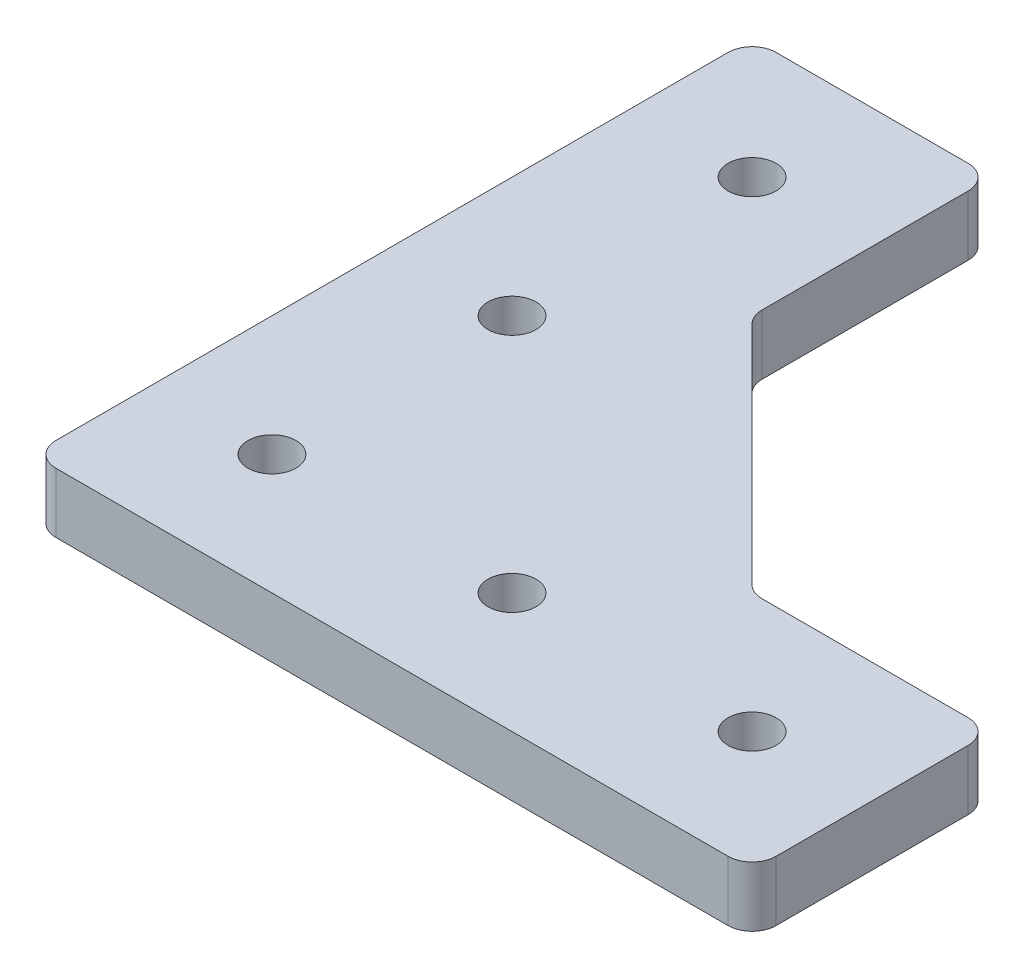
ISO-10303-21;
HEADER;
FILE_DESCRIPTION(('STEP AP214'),'2;1');
FILE_NAME('part.step','',(''),(''),'','','');
FILE_SCHEMA(('AUTOMOTIVE_DESIGN { 1 0 10303 214 1 1 1 1 }'));
ENDSEC;
DATA;
#1=APPLICATION_CONTEXT('core data for automotive mechanical design processes');
#2=APPLICATION_PROTOCOL_DEFINITION('international standard','automotive_design',2000,#1);
#3=PRODUCT_CONTEXT('',#1,'mechanical');
#4=PRODUCT('Part','Part','',(#3));
#5=PRODUCT_RELATED_PRODUCT_CATEGORY('part','',(#4));
#6=PRODUCT_DEFINITION_FORMATION('','',#4);
#7=PRODUCT_DEFINITION_CONTEXT('part definition',#1,'design');
#8=PRODUCT_DEFINITION('design','',#6,#7);
#9=PRODUCT_DEFINITION_SHAPE('','',#8);
#10=(LENGTH_UNIT() NAMED_UNIT(*) SI_UNIT(.MILLI.,.METRE.));
#11=(NAMED_UNIT(*) PLANE_ANGLE_UNIT() SI_UNIT($,.RADIAN.));
#12=(NAMED_UNIT(*) SI_UNIT($,.STERADIAN.) SOLID_ANGLE_UNIT());
#13=UNCERTAINTY_MEASURE_WITH_UNIT(LENGTH_MEASURE(1.E-05),#10,'distance_accuracy_value','');
#14=(GEOMETRIC_REPRESENTATION_CONTEXT(3) GLOBAL_UNCERTAINTY_ASSIGNED_CONTEXT((#13)) GLOBAL_UNIT_ASSIGNED_CONTEXT((#10,
#11,#12)) REPRESENTATION_CONTEXT('',''));
#15=CARTESIAN_POINT('',(0.,0.,0.));
#16=DIRECTION('',(0.,0.,1.));
#17=DIRECTION('',(1.,0.,0.));
#18=AXIS2_PLACEMENT_3D('',#15,#16,#17);
#19=CARTESIAN_POINT('',(0.,5.,10.));
#20=DIRECTION('',(0.,0.,1.));
#21=DIRECTION('',(1.,0.,0.));
#22=AXIS2_PLACEMENT_3D('',#19,#20,#21);
#23=PLANE('',#22);
#24=DIRECTION('',(-1.,0.,0.));
#25=VECTOR('',#24,1.);
#26=CARTESIAN_POINT('',(0.,5.,10.));
#27=LINE('',#26,#25);
#28=CARTESIAN_POINT('',(48.,5.,10.));
#29=VERTEX_POINT('',#28);
#30=CARTESIAN_POINT('',(-8.,5.,10.));
#31=VERTEX_POINT('',#30);
#32=EDGE_CURVE('E295',#29,#31,#27,.T.);
#33=ORIENTED_EDGE('',*,*,#32,.T.);
#34=DIRECTION('',(0.,-1.,0.));
#35=VECTOR('',#34,1.);
#36=CARTESIAN_POINT('',(-8.,0.,10.));
#37=LINE('',#36,#35);
#38=CARTESIAN_POINT('',(-8.,0.,10.));
#39=VERTEX_POINT('',#38);
#40=EDGE_CURVE('E164',#31,#39,#37,.T.);
#41=ORIENTED_EDGE('',*,*,#40,.T.);
#42=DIRECTION('',(-1.,0.,0.));
#43=VECTOR('',#42,1.);
#44=CARTESIAN_POINT('',(0.,0.,10.));
#45=LINE('',#44,#43);
#46=CARTESIAN_POINT('',(48.,0.,10.));
#47=VERTEX_POINT('',#46);
#48=EDGE_CURVE('E147',#47,#39,#45,.T.);
#49=ORIENTED_EDGE('',*,*,#48,.F.);
#50=DIRECTION('',(0.,-1.,0.));
#51=VECTOR('',#50,1.);
#52=CARTESIAN_POINT('',(48.,5.,10.));
#53=LINE('',#52,#51);
#54=EDGE_CURVE('E161',#47,#29,#53,.F.);
#55=ORIENTED_EDGE('',*,*,#54,.T.);
#56=EDGE_LOOP('',(#33,#41,#49,#55));
#57=FACE_BOUND('',#56,.T.);
#58=ADVANCED_FACE('F41',(#57),#23,.T.);
#59=CARTESIAN_POINT('',(50.,5.,0.));
#60=DIRECTION('',(1.,0.,0.));
#61=DIRECTION('',(0.,0.,-1.));
#62=AXIS2_PLACEMENT_3D('',#59,#60,#61);
#63=PLANE('',#62);
#64=DIRECTION('',(0.,0.,1.));
#65=VECTOR('',#64,1.);
#66=CARTESIAN_POINT('',(50.,5.,0.));
#67=LINE('',#66,#65);
#68=CARTESIAN_POINT('',(50.,5.,-8.));
#69=VERTEX_POINT('',#68);
#70=CARTESIAN_POINT('',(50.,5.,8.));
#71=VERTEX_POINT('',#70);
#72=EDGE_CURVE('E298',#69,#71,#67,.T.);
#73=ORIENTED_EDGE('',*,*,#72,.T.);
#74=DIRECTION('',(0.,-1.,0.));
#75=VECTOR('',#74,1.);
#76=CARTESIAN_POINT('',(50.,5.,8.));
#77=LINE('',#76,#75);
#78=CARTESIAN_POINT('',(50.,0.,8.));
#79=VERTEX_POINT('',#78);
#80=EDGE_CURVE('E225',#71,#79,#77,.T.);
#81=ORIENTED_EDGE('',*,*,#80,.T.);
#82=DIRECTION('',(0.,0.,1.));
#83=VECTOR('',#82,1.);
#84=CARTESIAN_POINT('',(50.,0.,0.));
#85=LINE('',#84,#83);
#86=CARTESIAN_POINT('',(50.,0.,-8.));
#87=VERTEX_POINT('',#86);
#88=EDGE_CURVE('E149',#87,#79,#85,.T.);
#89=ORIENTED_EDGE('',*,*,#88,.F.);
#90=DIRECTION('',(0.,-1.,0.));
#91=VECTOR('',#90,1.);
#92=CARTESIAN_POINT('',(50.,5.,-8.));
#93=LINE('',#92,#91);
#94=EDGE_CURVE('E222',#87,#69,#93,.F.);
#95=ORIENTED_EDGE('',*,*,#94,.T.);
#96=EDGE_LOOP('',(#73,#81,#89,#95));
#97=FACE_BOUND('',#96,.T.);
#98=ADVANCED_FACE('F369',(#97),#63,.T.);
#99=CARTESIAN_POINT('',(0.,5.,-10.));
#100=DIRECTION('',(0.,0.,1.));
#101=DIRECTION('',(1.,0.,0.));
#102=AXIS2_PLACEMENT_3D('',#99,#100,#101);
#103=PLANE('',#102);
#104=DIRECTION('',(-1.,0.,0.));
#105=VECTOR('',#104,1.);
#106=CARTESIAN_POINT('',(0.,0.,-10.));
#107=LINE('',#106,#105);
#108=CARTESIAN_POINT('',(48.,0.,-10.));
#109=VERTEX_POINT('',#108);
#110=CARTESIAN_POINT('',(30.8284271247462,0.,-10.));
#111=VERTEX_POINT('',#110);
#112=EDGE_CURVE('E258',#109,#111,#107,.T.);
#113=ORIENTED_EDGE('',*,*,#112,.T.);
#114=DIRECTION('',(0.,1.,0.));
#115=VECTOR('',#114,1.);
#116=CARTESIAN_POINT('',(30.8284271247462,5.,-10.));
#117=LINE('',#116,#115);
#118=CARTESIAN_POINT('',(30.8284271247462,5.,-10.));
#119=VERTEX_POINT('',#118);
#120=EDGE_CURVE('E235',#111,#119,#117,.T.);
#121=ORIENTED_EDGE('',*,*,#120,.T.);
#122=DIRECTION('',(-1.,0.,0.));
#123=VECTOR('',#122,1.);
#124=CARTESIAN_POINT('',(0.,5.,-10.));
#125=LINE('',#124,#123);
#126=CARTESIAN_POINT('',(48.,5.,-10.));
#127=VERTEX_POINT('',#126);
#128=EDGE_CURVE('E277',#127,#119,#125,.T.);
#129=ORIENTED_EDGE('',*,*,#128,.F.);
#130=DIRECTION('',(0.,-1.,0.));
#131=VECTOR('',#130,1.);
#132=CARTESIAN_POINT('',(48.,0.,-10.));
#133=LINE('',#132,#131);
#134=EDGE_CURVE('E231',#127,#109,#133,.T.);
#135=ORIENTED_EDGE('',*,*,#134,.T.);
#136=EDGE_LOOP('',(#113,#121,#129,#135));
#137=FACE_BOUND('',#136,.T.);
#138=ADVANCED_FACE('F265',(#137),#103,.F.);
#139=CARTESIAN_POINT('',(10.,5.,0.));
#140=DIRECTION('',(1.,0.,0.));
#141=DIRECTION('',(0.,0.,-1.));
#142=AXIS2_PLACEMENT_3D('',#139,#140,#141);
#143=PLANE('',#142);
#144=DIRECTION('',(0.,0.,1.));
#145=VECTOR('',#144,1.);
#146=CARTESIAN_POINT('',(10.,5.,0.));
#147=LINE('',#146,#145);
#148=CARTESIAN_POINT('',(10.,5.,-48.));
#149=VERTEX_POINT('',#148);
#150=CARTESIAN_POINT('',(10.,5.,-30.8284271247462));
#151=VERTEX_POINT('',#150);
#152=EDGE_CURVE('E304',#149,#151,#147,.T.);
#153=ORIENTED_EDGE('',*,*,#152,.T.);
#154=DIRECTION('',(0.,1.,0.));
#155=VECTOR('',#154,1.);
#156=CARTESIAN_POINT('',(10.,0.,-30.8284271247462));
#157=LINE('',#156,#155);
#158=CARTESIAN_POINT('',(10.,0.,-30.8284271247462));
#159=VERTEX_POINT('',#158);
#160=EDGE_CURVE('E63',#151,#159,#157,.F.);
#161=ORIENTED_EDGE('',*,*,#160,.T.);
#162=DIRECTION('',(0.,0.,1.));
#163=VECTOR('',#162,1.);
#164=CARTESIAN_POINT('',(10.,0.,0.));
#165=LINE('',#164,#163);
#166=CARTESIAN_POINT('',(10.,0.,-48.));
#167=VERTEX_POINT('',#166);
#168=EDGE_CURVE('E270',#167,#159,#165,.T.);
#169=ORIENTED_EDGE('',*,*,#168,.F.);
#170=DIRECTION('',(0.,-1.,0.));
#171=VECTOR('',#170,1.);
#172=CARTESIAN_POINT('',(10.,5.,-48.));
#173=LINE('',#172,#171);
#174=EDGE_CURVE('E228',#167,#149,#173,.F.);
#175=ORIENTED_EDGE('',*,*,#174,.T.);
#176=EDGE_LOOP('',(#153,#161,#169,#175));
#177=FACE_BOUND('',#176,.T.);
#178=ADVANCED_FACE('F450',(#177),#143,.T.);
#179=CARTESIAN_POINT('',(0.,5.,-50.));
#180=DIRECTION('',(0.,0.,-1.));
#181=DIRECTION('',(-1.,0.,0.));
#182=AXIS2_PLACEMENT_3D('',#179,#180,#181);
#183=PLANE('',#182);
#184=DIRECTION('',(1.,0.,0.));
#185=VECTOR('',#184,1.);
#186=CARTESIAN_POINT('',(0.,0.,-50.));
#187=LINE('',#186,#185);
#188=CARTESIAN_POINT('',(-8.,0.,-50.));
#189=VERTEX_POINT('',#188);
#190=CARTESIAN_POINT('',(8.,0.,-50.));
#191=VERTEX_POINT('',#190);
#192=EDGE_CURVE('E332',#189,#191,#187,.T.);
#193=ORIENTED_EDGE('',*,*,#192,.F.);
#194=DIRECTION('',(0.,-1.,0.));
#195=VECTOR('',#194,1.);
#196=CARTESIAN_POINT('',(-8.,5.,-50.));
#197=LINE('',#196,#195);
#198=CARTESIAN_POINT('',(-8.,5.,-50.));
#199=VERTEX_POINT('',#198);
#200=EDGE_CURVE('E219',#189,#199,#197,.F.);
#201=ORIENTED_EDGE('',*,*,#200,.T.);
#202=DIRECTION('',(1.,0.,0.));
#203=VECTOR('',#202,1.);
#204=CARTESIAN_POINT('',(0.,5.,-50.));
#205=LINE('',#204,#203);
#206=CARTESIAN_POINT('',(8.,5.,-50.));
#207=VERTEX_POINT('',#206);
#208=EDGE_CURVE('E307',#199,#207,#205,.T.);
#209=ORIENTED_EDGE('',*,*,#208,.T.);
#210=DIRECTION('',(0.,-1.,0.));
#211=VECTOR('',#210,1.);
#212=CARTESIAN_POINT('',(8.,5.,-50.));
#213=LINE('',#212,#211);
#214=EDGE_CURVE('E215',#207,#191,#213,.T.);
#215=ORIENTED_EDGE('',*,*,#214,.T.);
#216=EDGE_LOOP('',(#193,#201,#209,#215));
#217=FACE_BOUND('',#216,.T.);
#218=ADVANCED_FACE('F458',(#217),#183,.T.);
#219=CARTESIAN_POINT('',(0.,5.,-20.));
#220=DIRECTION('',(0.,-1.,0.));
#221=DIRECTION('',(0.,0.,-1.));
#222=AXIS2_PLACEMENT_3D('',#219,#220,#221);
#223=CYLINDRICAL_SURFACE('',#222,2.);
#224=CARTESIAN_POINT('',(0.,5.,-20.));
#225=DIRECTION('',(0.,1.,0.));
#226=DIRECTION('',(0.,0.,1.));
#227=AXIS2_PLACEMENT_3D('',#224,#225,#226);
#228=CIRCLE('',#227,2.);
#229=CARTESIAN_POINT('',(0.,5.,-18.));
#230=VERTEX_POINT('',#229);
#231=EDGE_CURVE('E179',#230,#230,#228,.T.);
#232=ORIENTED_EDGE('',*,*,#231,.T.);
#233=EDGE_LOOP('',(#232));
#234=FACE_BOUND('',#233,.T.);
#235=CARTESIAN_POINT('',(0.,0.,-20.));
#236=DIRECTION('',(0.,1.,0.));
#237=DIRECTION('',(0.,0.,1.));
#238=AXIS2_PLACEMENT_3D('',#235,#236,#237);
#239=CIRCLE('',#238,2.);
#240=CARTESIAN_POINT('',(0.,0.,-18.));
#241=VERTEX_POINT('',#240);
#242=EDGE_CURVE('E343',#241,#241,#239,.T.);
#243=ORIENTED_EDGE('',*,*,#242,.F.);
#244=EDGE_LOOP('',(#243));
#245=FACE_BOUND('',#244,.T.);
#246=ADVANCED_FACE('F542',(#234,#245),#223,.F.);
#247=CARTESIAN_POINT('',(0.,5.,0.));
#248=DIRECTION('',(0.,-1.,0.));
#249=DIRECTION('',(0.,0.,-1.));
#250=AXIS2_PLACEMENT_3D('',#247,#248,#249);
#251=CYLINDRICAL_SURFACE('',#250,2.);
#252=CARTESIAN_POINT('',(0.,5.,0.));
#253=DIRECTION('',(0.,1.,0.));
#254=DIRECTION('',(0.,0.,1.));
#255=AXIS2_PLACEMENT_3D('',#252,#253,#254);
#256=CIRCLE('',#255,2.);
#257=CARTESIAN_POINT('',(0.,5.,2.));
#258=VERTEX_POINT('',#257);
#259=EDGE_CURVE('E315',#258,#258,#256,.T.);
#260=ORIENTED_EDGE('',*,*,#259,.T.);
#261=EDGE_LOOP('',(#260));
#262=FACE_BOUND('',#261,.T.);
#263=CARTESIAN_POINT('',(0.,0.,0.));
#264=DIRECTION('',(0.,1.,0.));
#265=DIRECTION('',(0.,0.,1.));
#266=AXIS2_PLACEMENT_3D('',#263,#264,#265);
#267=CIRCLE('',#266,2.);
#268=CARTESIAN_POINT('',(0.,0.,2.));
#269=VERTEX_POINT('',#268);
#270=EDGE_CURVE('E340',#269,#269,#267,.T.);
#271=ORIENTED_EDGE('',*,*,#270,.F.);
#272=EDGE_LOOP('',(#271));
#273=FACE_BOUND('',#272,.T.);
#274=ADVANCED_FACE('F530',(#262,#273),#251,.F.);
#275=CARTESIAN_POINT('',(-10.,5.,0.));
#276=DIRECTION('',(1.,0.,0.));
#277=DIRECTION('',(0.,0.,-1.));
#278=AXIS2_PLACEMENT_3D('',#275,#276,#277);
#279=PLANE('',#278);
#280=DIRECTION('',(0.,0.,1.));
#281=VECTOR('',#280,1.);
#282=CARTESIAN_POINT('',(-10.,0.,0.));
#283=LINE('',#282,#281);
#284=CARTESIAN_POINT('',(-10.,0.,-48.));
#285=VERTEX_POINT('',#284);
#286=CARTESIAN_POINT('',(-10.,0.,8.));
#287=VERTEX_POINT('',#286);
#288=EDGE_CURVE('E336',#285,#287,#283,.T.);
#289=ORIENTED_EDGE('',*,*,#288,.T.);
#290=DIRECTION('',(0.,-1.,0.));
#291=VECTOR('',#290,1.);
#292=CARTESIAN_POINT('',(-10.,5.,8.));
#293=LINE('',#292,#291);
#294=CARTESIAN_POINT('',(-10.,5.,8.));
#295=VERTEX_POINT('',#294);
#296=EDGE_CURVE('E198',#287,#295,#293,.F.);
#297=ORIENTED_EDGE('',*,*,#296,.T.);
#298=DIRECTION('',(0.,0.,1.));
#299=VECTOR('',#298,1.);
#300=CARTESIAN_POINT('',(-10.,5.,0.));
#301=LINE('',#300,#299);
#302=CARTESIAN_POINT('',(-10.,5.,-48.));
#303=VERTEX_POINT('',#302);
#304=EDGE_CURVE('E311',#303,#295,#301,.T.);
#305=ORIENTED_EDGE('',*,*,#304,.F.);
#306=DIRECTION('',(0.,-1.,0.));
#307=VECTOR('',#306,1.);
#308=CARTESIAN_POINT('',(-10.,0.,-48.));
#309=LINE('',#308,#307);
#310=EDGE_CURVE('E194',#303,#285,#309,.T.);
#311=ORIENTED_EDGE('',*,*,#310,.T.);
#312=EDGE_LOOP('',(#289,#297,#305,#311));
#313=FACE_BOUND('',#312,.T.);
#314=ADVANCED_FACE('F379',(#313),#279,.F.);
#315=CARTESIAN_POINT('',(40.,5.,0.));
#316=DIRECTION('',(0.,-1.,0.));
#317=DIRECTION('',(0.,0.,-1.));
#318=AXIS2_PLACEMENT_3D('',#315,#316,#317);
#319=CYLINDRICAL_SURFACE('',#318,2.);
#320=CARTESIAN_POINT('',(40.,5.,0.));
#321=DIRECTION('',(0.,1.,0.));
#322=DIRECTION('',(0.,0.,1.));
#323=AXIS2_PLACEMENT_3D('',#320,#321,#322);
#324=CIRCLE('',#323,2.);
#325=CARTESIAN_POINT('',(40.,5.,2.));
#326=VERTEX_POINT('',#325);
#327=EDGE_CURVE('E291',#326,#326,#324,.T.);
#328=ORIENTED_EDGE('',*,*,#327,.T.);
#329=EDGE_LOOP('',(#328));
#330=FACE_BOUND('',#329,.T.);
#331=CARTESIAN_POINT('',(40.,0.,0.));
#332=DIRECTION('',(0.,1.,0.));
#333=DIRECTION('',(0.,0.,1.));
#334=AXIS2_PLACEMENT_3D('',#331,#332,#333);
#335=CIRCLE('',#334,2.);
#336=CARTESIAN_POINT('',(40.,0.,2.));
#337=VERTEX_POINT('',#336);
#338=EDGE_CURVE('E166',#337,#337,#335,.T.);
#339=ORIENTED_EDGE('',*,*,#338,.F.);
#340=EDGE_LOOP('',(#339));
#341=FACE_BOUND('',#340,.T.);
#342=ADVANCED_FACE('F363',(#330,#341),#319,.F.);
#343=CARTESIAN_POINT('',(20.,5.,0.));
#344=DIRECTION('',(0.,-1.,0.));
#345=DIRECTION('',(0.,0.,-1.));
#346=AXIS2_PLACEMENT_3D('',#343,#344,#345);
#347=CYLINDRICAL_SURFACE('',#346,2.);
#348=CARTESIAN_POINT('',(20.,5.,0.));
#349=DIRECTION('',(0.,1.,0.));
#350=DIRECTION('',(0.,0.,1.));
#351=AXIS2_PLACEMENT_3D('',#348,#349,#350);
#352=CIRCLE('',#351,2.);
#353=CARTESIAN_POINT('',(20.,5.,2.));
#354=VERTEX_POINT('',#353);
#355=EDGE_CURVE('E287',#354,#354,#352,.T.);
#356=ORIENTED_EDGE('',*,*,#355,.T.);
#357=EDGE_LOOP('',(#356));
#358=FACE_BOUND('',#357,.T.);
#359=CARTESIAN_POINT('',(20.,0.,0.));
#360=DIRECTION('',(0.,1.,0.));
#361=DIRECTION('',(0.,0.,1.));
#362=AXIS2_PLACEMENT_3D('',#359,#360,#361);
#363=CIRCLE('',#362,2.);
#364=CARTESIAN_POINT('',(20.,0.,2.));
#365=VERTEX_POINT('',#364);
#366=EDGE_CURVE('E284',#365,#365,#363,.T.);
#367=ORIENTED_EDGE('',*,*,#366,.F.);
#368=EDGE_LOOP('',(#367));
#369=FACE_BOUND('',#368,.T.);
#370=ADVANCED_FACE('F355',(#358,#369),#347,.F.);
#371=CARTESIAN_POINT('',(0.,5.,-40.));
#372=DIRECTION('',(0.,-1.,0.));
#373=DIRECTION('',(0.,0.,-1.));
#374=AXIS2_PLACEMENT_3D('',#371,#372,#373);
#375=CYLINDRICAL_SURFACE('',#374,2.);
#376=CARTESIAN_POINT('',(0.,5.,-40.));
#377=DIRECTION('',(0.,1.,0.));
#378=DIRECTION('',(0.,0.,1.));
#379=AXIS2_PLACEMENT_3D('',#376,#377,#378);
#380=CIRCLE('',#379,2.);
#381=CARTESIAN_POINT('',(0.,5.,-38.));
#382=VERTEX_POINT('',#381);
#383=EDGE_CURVE('E172',#382,#382,#380,.T.);
#384=ORIENTED_EDGE('',*,*,#383,.T.);
#385=EDGE_LOOP('',(#384));
#386=FACE_BOUND('',#385,.T.);
#387=CARTESIAN_POINT('',(0.,0.,-40.));
#388=DIRECTION('',(0.,1.,0.));
#389=DIRECTION('',(0.,0.,1.));
#390=AXIS2_PLACEMENT_3D('',#387,#388,#389);
#391=CIRCLE('',#390,2.);
#392=CARTESIAN_POINT('',(0.,0.,-38.));
#393=VERTEX_POINT('',#392);
#394=EDGE_CURVE('E182',#393,#393,#391,.T.);
#395=ORIENTED_EDGE('',*,*,#394,.F.);
#396=EDGE_LOOP('',(#395));
#397=FACE_BOUND('',#396,.T.);
#398=ADVANCED_FACE('F353',(#386,#397),#375,.F.);
#399=CARTESIAN_POINT('',(0.,5.,0.));
#400=DIRECTION('',(0.,1.,0.));
#401=DIRECTION('',(0.,0.,1.));
#402=AXIS2_PLACEMENT_3D('',#399,#400,#401);
#403=PLANE('',#402);
#404=ORIENTED_EDGE('',*,*,#128,.T.);
#405=CARTESIAN_POINT('',(30.8284271247462,5.,-12.));
#406=DIRECTION('',(0.,1.,0.));
#407=DIRECTION('',(0.,0.,1.));
#408=AXIS2_PLACEMENT_3D('',#405,#406,#407);
#409=CIRCLE('',#408,2.);
#410=CARTESIAN_POINT('',(29.4142135623731,5.,-10.5857864376269));
#411=VERTEX_POINT('',#410);
#412=EDGE_CURVE('E248',#119,#411,#409,.F.);
#413=ORIENTED_EDGE('',*,*,#412,.T.);
#414=DIRECTION('',(-0.707106781186548,0.,-0.707106781186548));
#415=VECTOR('',#414,1.);
#416=CARTESIAN_POINT('',(10.,5.,-30.));
#417=LINE('',#416,#415);
#418=CARTESIAN_POINT('',(10.5857864376269,5.,-29.4142135623731));
#419=VERTEX_POINT('',#418);
#420=EDGE_CURVE('E276',#411,#419,#417,.T.);
#421=ORIENTED_EDGE('',*,*,#420,.T.);
#422=CARTESIAN_POINT('',(12.,5.,-30.8284271247462));
#423=DIRECTION('',(0.,1.,0.));
#424=DIRECTION('',(0.,0.,1.));
#425=AXIS2_PLACEMENT_3D('',#422,#423,#424);
#426=CIRCLE('',#425,2.);
#427=EDGE_CURVE('E50',#419,#151,#426,.F.);
#428=ORIENTED_EDGE('',*,*,#427,.T.);
#429=ORIENTED_EDGE('',*,*,#152,.F.);
#430=CARTESIAN_POINT('',(8.,5.,-48.));
#431=DIRECTION('',(0.,1.,0.));
#432=DIRECTION('',(0.,0.,1.));
#433=AXIS2_PLACEMENT_3D('',#430,#431,#432);
#434=CIRCLE('',#433,2.);
#435=EDGE_CURVE('E204',#149,#207,#434,.T.);
#436=ORIENTED_EDGE('',*,*,#435,.T.);
#437=ORIENTED_EDGE('',*,*,#208,.F.);
#438=CARTESIAN_POINT('',(-8.,5.,-48.));
#439=DIRECTION('',(0.,1.,0.));
#440=DIRECTION('',(0.,0.,1.));
#441=AXIS2_PLACEMENT_3D('',#438,#439,#440);
#442=CIRCLE('',#441,2.);
#443=EDGE_CURVE('E209',#199,#303,#442,.T.);
#444=ORIENTED_EDGE('',*,*,#443,.T.);
#445=ORIENTED_EDGE('',*,*,#304,.T.);
#446=CARTESIAN_POINT('',(-8.,5.,8.));
#447=DIRECTION('',(0.,1.,0.));
#448=DIRECTION('',(0.,0.,1.));
#449=AXIS2_PLACEMENT_3D('',#446,#447,#448);
#450=CIRCLE('',#449,2.);
#451=EDGE_CURVE('E212',#295,#31,#450,.T.);
#452=ORIENTED_EDGE('',*,*,#451,.T.);
#453=ORIENTED_EDGE('',*,*,#32,.F.);
#454=CARTESIAN_POINT('',(48.,5.,8.));
#455=DIRECTION('',(0.,1.,0.));
#456=DIRECTION('',(0.,0.,1.));
#457=AXIS2_PLACEMENT_3D('',#454,#455,#456);
#458=CIRCLE('',#457,2.);
#459=EDGE_CURVE('E170',#29,#71,#458,.T.);
#460=ORIENTED_EDGE('',*,*,#459,.T.);
#461=ORIENTED_EDGE('',*,*,#72,.F.);
#462=CARTESIAN_POINT('',(48.,5.,-8.));
#463=DIRECTION('',(0.,1.,0.));
#464=DIRECTION('',(0.,0.,1.));
#465=AXIS2_PLACEMENT_3D('',#462,#463,#464);
#466=CIRCLE('',#465,2.);
#467=EDGE_CURVE('E201',#69,#127,#466,.T.);
#468=ORIENTED_EDGE('',*,*,#467,.T.);
#469=EDGE_LOOP('',(#404,#413,#421,#428,#429,#436,#437,#444,#445,#452,#453,#460,#461,#468));
#470=FACE_BOUND('',#469,.T.);
#471=ORIENTED_EDGE('',*,*,#355,.F.);
#472=EDGE_LOOP('',(#471));
#473=FACE_BOUND('',#472,.T.);
#474=ORIENTED_EDGE('',*,*,#327,.F.);
#475=EDGE_LOOP('',(#474));
#476=FACE_BOUND('',#475,.T.);
#477=ORIENTED_EDGE('',*,*,#259,.F.);
#478=EDGE_LOOP('',(#477));
#479=FACE_BOUND('',#478,.T.);
#480=ORIENTED_EDGE('',*,*,#231,.F.);
#481=EDGE_LOOP('',(#480));
#482=FACE_BOUND('',#481,.T.);
#483=ORIENTED_EDGE('',*,*,#383,.F.);
#484=EDGE_LOOP('',(#483));
#485=FACE_BOUND('',#484,.T.);
#486=ADVANCED_FACE('F274',(#470,#473,#476,#479,#482,#485),#403,.T.);
#487=CARTESIAN_POINT('',(0.,0.,0.));
#488=DIRECTION('',(0.,1.,0.));
#489=DIRECTION('',(0.,0.,1.));
#490=AXIS2_PLACEMENT_3D('',#487,#488,#489);
#491=PLANE('',#490);
#492=ORIENTED_EDGE('',*,*,#366,.T.);
#493=EDGE_LOOP('',(#492));
#494=FACE_BOUND('',#493,.T.);
#495=ORIENTED_EDGE('',*,*,#338,.T.);
#496=EDGE_LOOP('',(#495));
#497=FACE_BOUND('',#496,.T.);
#498=ORIENTED_EDGE('',*,*,#168,.T.);
#499=CARTESIAN_POINT('',(12.,0.,-30.8284271247462));
#500=DIRECTION('',(0.,1.,0.));
#501=DIRECTION('',(0.,0.,1.));
#502=AXIS2_PLACEMENT_3D('',#499,#500,#501);
#503=CIRCLE('',#502,2.);
#504=CARTESIAN_POINT('',(10.5857864376269,0.,-29.4142135623731));
#505=VERTEX_POINT('',#504);
#506=EDGE_CURVE('E11',#159,#505,#503,.T.);
#507=ORIENTED_EDGE('',*,*,#506,.T.);
#508=DIRECTION('',(-0.707106781186548,0.,-0.707106781186548));
#509=VECTOR('',#508,1.);
#510=CARTESIAN_POINT('',(10.,0.,-30.));
#511=LINE('',#510,#509);
#512=CARTESIAN_POINT('',(29.4142135623731,0.,-10.5857864376269));
#513=VERTEX_POINT('',#512);
#514=EDGE_CURVE('E260',#513,#505,#511,.T.);
#515=ORIENTED_EDGE('',*,*,#514,.F.);
#516=CARTESIAN_POINT('',(30.8284271247462,0.,-12.));
#517=DIRECTION('',(0.,1.,0.));
#518=DIRECTION('',(0.,0.,1.));
#519=AXIS2_PLACEMENT_3D('',#516,#517,#518);
#520=CIRCLE('',#519,2.);
#521=EDGE_CURVE('E251',#513,#111,#520,.T.);
#522=ORIENTED_EDGE('',*,*,#521,.T.);
#523=ORIENTED_EDGE('',*,*,#112,.F.);
#524=CARTESIAN_POINT('',(48.,0.,-8.));
#525=DIRECTION('',(0.,1.,0.));
#526=DIRECTION('',(0.,0.,1.));
#527=AXIS2_PLACEMENT_3D('',#524,#525,#526);
#528=CIRCLE('',#527,2.);
#529=EDGE_CURVE('E176',#109,#87,#528,.F.);
#530=ORIENTED_EDGE('',*,*,#529,.T.);
#531=ORIENTED_EDGE('',*,*,#88,.T.);
#532=CARTESIAN_POINT('',(48.,0.,8.));
#533=DIRECTION('',(0.,1.,0.));
#534=DIRECTION('',(0.,0.,1.));
#535=AXIS2_PLACEMENT_3D('',#532,#533,#534);
#536=CIRCLE('',#535,2.);
#537=EDGE_CURVE('E143',#79,#47,#536,.F.);
#538=ORIENTED_EDGE('',*,*,#537,.T.);
#539=ORIENTED_EDGE('',*,*,#48,.T.);
#540=CARTESIAN_POINT('',(-8.,0.,8.));
#541=DIRECTION('',(0.,1.,0.));
#542=DIRECTION('',(0.,0.,1.));
#543=AXIS2_PLACEMENT_3D('',#540,#541,#542);
#544=CIRCLE('',#543,2.);
#545=EDGE_CURVE('E191',#39,#287,#544,.F.);
#546=ORIENTED_EDGE('',*,*,#545,.T.);
#547=ORIENTED_EDGE('',*,*,#288,.F.);
#548=CARTESIAN_POINT('',(-8.,0.,-48.));
#549=DIRECTION('',(0.,1.,0.));
#550=DIRECTION('',(0.,0.,1.));
#551=AXIS2_PLACEMENT_3D('',#548,#549,#550);
#552=CIRCLE('',#551,2.);
#553=EDGE_CURVE('E155',#285,#189,#552,.F.);
#554=ORIENTED_EDGE('',*,*,#553,.T.);
#555=ORIENTED_EDGE('',*,*,#192,.T.);
#556=CARTESIAN_POINT('',(8.,0.,-48.));
#557=DIRECTION('',(0.,1.,0.));
#558=DIRECTION('',(0.,0.,1.));
#559=AXIS2_PLACEMENT_3D('',#556,#557,#558);
#560=CIRCLE('',#559,2.);
#561=EDGE_CURVE('E156',#191,#167,#560,.F.);
#562=ORIENTED_EDGE('',*,*,#561,.T.);
#563=EDGE_LOOP('',(#498,#507,#515,#522,#523,#530,#531,#538,#539,#546,#547,#554,#555,#562));
#564=FACE_BOUND('',#563,.T.);
#565=ORIENTED_EDGE('',*,*,#270,.T.);
#566=EDGE_LOOP('',(#565));
#567=FACE_BOUND('',#566,.T.);
#568=ORIENTED_EDGE('',*,*,#242,.T.);
#569=EDGE_LOOP('',(#568));
#570=FACE_BOUND('',#569,.T.);
#571=ORIENTED_EDGE('',*,*,#394,.T.);
#572=EDGE_LOOP('',(#571));
#573=FACE_BOUND('',#572,.T.);
#574=ADVANCED_FACE('F145',(#494,#497,#564,#567,#570,#573),#491,.F.);
#575=CARTESIAN_POINT('',(-8.,5.,8.));
#576=DIRECTION('',(0.,1.,0.));
#577=DIRECTION('',(0.,0.,1.));
#578=AXIS2_PLACEMENT_3D('',#575,#576,#577);
#579=CYLINDRICAL_SURFACE('',#578,2.);
#580=ORIENTED_EDGE('',*,*,#451,.F.);
#581=ORIENTED_EDGE('',*,*,#296,.F.);
#582=ORIENTED_EDGE('',*,*,#545,.F.);
#583=ORIENTED_EDGE('',*,*,#40,.F.);
#584=EDGE_LOOP('',(#580,#581,#582,#583));
#585=FACE_BOUND('',#584,.T.);
#586=ADVANCED_FACE('F382',(#585),#579,.T.);
#587=CARTESIAN_POINT('',(-8.,5.,-48.));
#588=DIRECTION('',(0.,1.,0.));
#589=DIRECTION('',(0.,0.,1.));
#590=AXIS2_PLACEMENT_3D('',#587,#588,#589);
#591=CYLINDRICAL_SURFACE('',#590,2.);
#592=ORIENTED_EDGE('',*,*,#443,.F.);
#593=ORIENTED_EDGE('',*,*,#200,.F.);
#594=ORIENTED_EDGE('',*,*,#553,.F.);
#595=ORIENTED_EDGE('',*,*,#310,.F.);
#596=EDGE_LOOP('',(#592,#593,#594,#595));
#597=FACE_BOUND('',#596,.T.);
#598=ADVANCED_FACE('F385',(#597),#591,.T.);
#599=CARTESIAN_POINT('',(48.,5.,8.));
#600=DIRECTION('',(0.,-1.,0.));
#601=DIRECTION('',(0.,0.,-1.));
#602=AXIS2_PLACEMENT_3D('',#599,#600,#601);
#603=CYLINDRICAL_SURFACE('',#602,2.);
#604=ORIENTED_EDGE('',*,*,#459,.F.);
#605=ORIENTED_EDGE('',*,*,#54,.F.);
#606=ORIENTED_EDGE('',*,*,#537,.F.);
#607=ORIENTED_EDGE('',*,*,#80,.F.);
#608=EDGE_LOOP('',(#604,#605,#606,#607));
#609=FACE_BOUND('',#608,.T.);
#610=ADVANCED_FACE('F169',(#609),#603,.T.);
#611=CARTESIAN_POINT('',(8.,5.,-48.));
#612=DIRECTION('',(0.,-1.,0.));
#613=DIRECTION('',(0.,0.,-1.));
#614=AXIS2_PLACEMENT_3D('',#611,#612,#613);
#615=CYLINDRICAL_SURFACE('',#614,2.);
#616=ORIENTED_EDGE('',*,*,#435,.F.);
#617=ORIENTED_EDGE('',*,*,#174,.F.);
#618=ORIENTED_EDGE('',*,*,#561,.F.);
#619=ORIENTED_EDGE('',*,*,#214,.F.);
#620=EDGE_LOOP('',(#616,#617,#618,#619));
#621=FACE_BOUND('',#620,.T.);
#622=ADVANCED_FACE('F392',(#621),#615,.T.);
#623=CARTESIAN_POINT('',(48.,5.,-8.));
#624=DIRECTION('',(0.,1.,0.));
#625=DIRECTION('',(0.,0.,1.));
#626=AXIS2_PLACEMENT_3D('',#623,#624,#625);
#627=CYLINDRICAL_SURFACE('',#626,2.);
#628=ORIENTED_EDGE('',*,*,#467,.F.);
#629=ORIENTED_EDGE('',*,*,#94,.F.);
#630=ORIENTED_EDGE('',*,*,#529,.F.);
#631=ORIENTED_EDGE('',*,*,#134,.F.);
#632=EDGE_LOOP('',(#628,#629,#630,#631));
#633=FACE_BOUND('',#632,.T.);
#634=ADVANCED_FACE('F395',(#633),#627,.T.);
#635=CARTESIAN_POINT('',(10.,0.,-30.));
#636=DIRECTION('',(0.707106781186548,0.,-0.707106781186548));
#637=DIRECTION('',(-0.707106781186548,0.,-0.707106781186548));
#638=AXIS2_PLACEMENT_3D('',#635,#636,#637);
#639=PLANE('',#638);
#640=ORIENTED_EDGE('',*,*,#420,.F.);
#641=DIRECTION('',(0.,1.,0.));
#642=VECTOR('',#641,1.);
#643=CARTESIAN_POINT('',(29.4142135623731,0.,-10.5857864376269));
#644=LINE('',#643,#642);
#645=EDGE_CURVE('E243',#411,#513,#644,.F.);
#646=ORIENTED_EDGE('',*,*,#645,.T.);
#647=ORIENTED_EDGE('',*,*,#514,.T.);
#648=DIRECTION('',(0.,1.,0.));
#649=VECTOR('',#648,1.);
#650=CARTESIAN_POINT('',(10.5857864376269,5.,-29.4142135623731));
#651=LINE('',#650,#649);
#652=EDGE_CURVE('E239',#505,#419,#651,.T.);
#653=ORIENTED_EDGE('',*,*,#652,.T.);
#654=EDGE_LOOP('',(#640,#646,#647,#653));
#655=FACE_BOUND('',#654,.T.);
#656=ADVANCED_FACE('F279',(#655),#639,.T.);
#657=CARTESIAN_POINT('',(30.8284271247462,5.,-12.));
#658=DIRECTION('',(0.,1.,0.));
#659=DIRECTION('',(0.,0.,1.));
#660=AXIS2_PLACEMENT_3D('',#657,#658,#659);
#661=CYLINDRICAL_SURFACE('',#660,2.);
#662=ORIENTED_EDGE('',*,*,#521,.F.);
#663=ORIENTED_EDGE('',*,*,#645,.F.);
#664=ORIENTED_EDGE('',*,*,#412,.F.);
#665=ORIENTED_EDGE('',*,*,#120,.F.);
#666=EDGE_LOOP('',(#662,#663,#664,#665));
#667=FACE_BOUND('',#666,.T.);
#668=ADVANCED_FACE('F272',(#667),#661,.F.);
#669=CARTESIAN_POINT('',(12.,0.,-30.8284271247462));
#670=DIRECTION('',(0.,-1.,0.));
#671=DIRECTION('',(0.,0.,-1.));
#672=AXIS2_PLACEMENT_3D('',#669,#670,#671);
#673=CYLINDRICAL_SURFACE('',#672,2.);
#674=ORIENTED_EDGE('',*,*,#506,.F.);
#675=ORIENTED_EDGE('',*,*,#160,.F.);
#676=ORIENTED_EDGE('',*,*,#427,.F.);
#677=ORIENTED_EDGE('',*,*,#652,.F.);
#678=EDGE_LOOP('',(#674,#675,#676,#677));
#679=FACE_BOUND('',#678,.T.);
#680=ADVANCED_FACE('F43',(#679),#673,.F.);
#681=CLOSED_SHELL('',(#58,#98,#138,#178,#218,#246,#274,#314,#342,#370,#398,#486,#574,#586,#598,
#610,#622,#634,#656,#668,#680));
#682=MANIFOLD_SOLID_BREP('B2',#681);
#683=ADVANCED_BREP_SHAPE_REPRESENTATION('',(#18,#682),#14);
#684=SHAPE_DEFINITION_REPRESENTATION(#9,#683);
ENDSEC;
END-ISO-10303-21;
